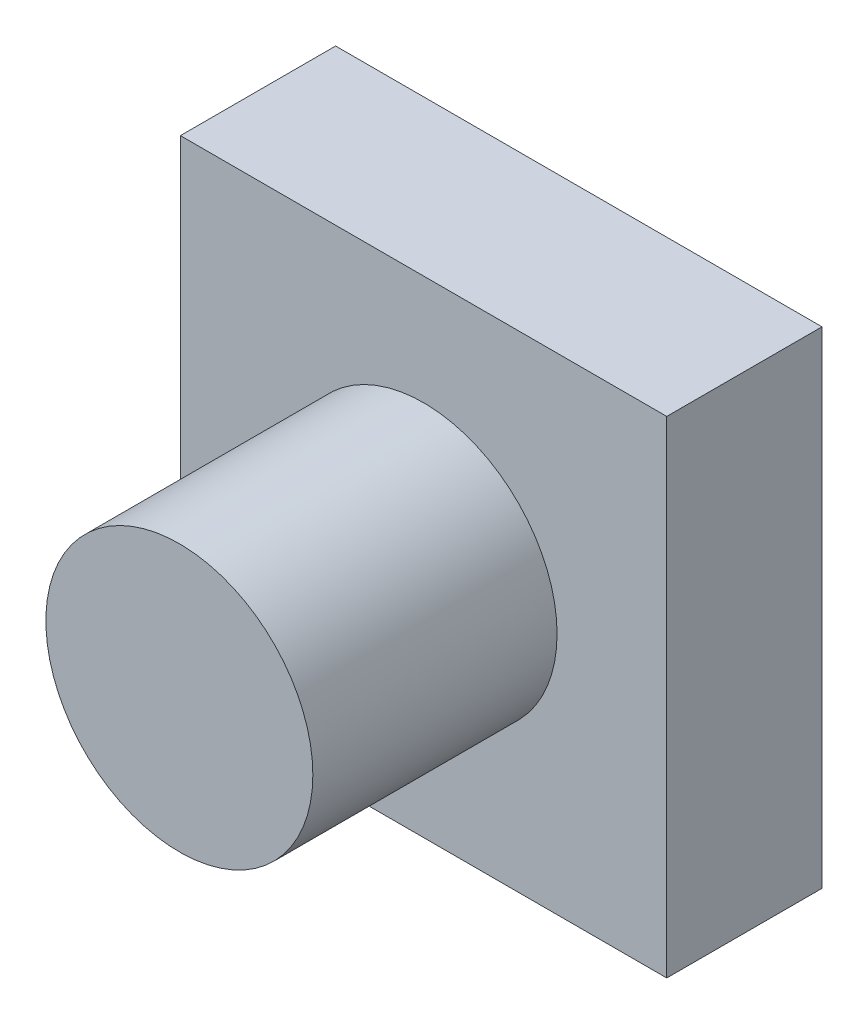
ISO-10303-21;
HEADER;
FILE_DESCRIPTION(('STEP AP214'),'2;1');
FILE_NAME('part.step','',(''),(''),'','','');
FILE_SCHEMA(('AUTOMOTIVE_DESIGN { 1 0 10303 214 1 1 1 1 }'));
ENDSEC;
DATA;
#1=APPLICATION_CONTEXT('core data for automotive mechanical design processes');
#2=APPLICATION_PROTOCOL_DEFINITION('international standard','automotive_design',2000,#1);
#3=PRODUCT_CONTEXT('',#1,'mechanical');
#4=PRODUCT('Part','Part','',(#3));
#5=PRODUCT_RELATED_PRODUCT_CATEGORY('part','',(#4));
#6=PRODUCT_DEFINITION_FORMATION('','',#4);
#7=PRODUCT_DEFINITION_CONTEXT('part definition',#1,'design');
#8=PRODUCT_DEFINITION('design','',#6,#7);
#9=PRODUCT_DEFINITION_SHAPE('','',#8);
#10=(LENGTH_UNIT() NAMED_UNIT(*) SI_UNIT(.MILLI.,.METRE.));
#11=(NAMED_UNIT(*) PLANE_ANGLE_UNIT() SI_UNIT($,.RADIAN.));
#12=(NAMED_UNIT(*) SI_UNIT($,.STERADIAN.) SOLID_ANGLE_UNIT());
#13=UNCERTAINTY_MEASURE_WITH_UNIT(LENGTH_MEASURE(1.E-05),#10,'distance_accuracy_value','');
#14=(GEOMETRIC_REPRESENTATION_CONTEXT(3) GLOBAL_UNCERTAINTY_ASSIGNED_CONTEXT((#13)) GLOBAL_UNIT_ASSIGNED_CONTEXT((#10,
#11,#12)) REPRESENTATION_CONTEXT('',''));
#15=CARTESIAN_POINT('',(0.,0.,0.));
#16=DIRECTION('',(0.,0.,1.));
#17=DIRECTION('',(1.,0.,0.));
#18=AXIS2_PLACEMENT_3D('',#15,#16,#17);
#19=CARTESIAN_POINT('',(0.,0.,3.81));
#20=DIRECTION('',(1.,0.,0.));
#21=DIRECTION('',(0.,0.,-1.));
#22=AXIS2_PLACEMENT_3D('',#19,#20,#21);
#23=PLANE('',#22);
#24=DIRECTION('',(0.,-1.,0.));
#25=VECTOR('',#24,1.);
#26=CARTESIAN_POINT('',(0.,0.,0.));
#27=LINE('',#26,#25);
#28=CARTESIAN_POINT('',(0.,11.938,0.));
#29=VERTEX_POINT('',#28);
#30=CARTESIAN_POINT('',(0.,0.,0.));
#31=VERTEX_POINT('',#30);
#32=EDGE_CURVE('E103',#29,#31,#27,.T.);
#33=ORIENTED_EDGE('',*,*,#32,.T.);
#34=DIRECTION('',(0.,0.,-1.));
#35=VECTOR('',#34,1.);
#36=CARTESIAN_POINT('',(0.,0.,3.81));
#37=LINE('',#36,#35);
#38=CARTESIAN_POINT('',(0.,0.,3.81));
#39=VERTEX_POINT('',#38);
#40=EDGE_CURVE('E40',#39,#31,#37,.T.);
#41=ORIENTED_EDGE('',*,*,#40,.F.);
#42=DIRECTION('',(0.,-1.,0.));
#43=VECTOR('',#42,1.);
#44=CARTESIAN_POINT('',(0.,0.,3.81));
#45=LINE('',#44,#43);
#46=CARTESIAN_POINT('',(0.,11.938,3.81));
#47=VERTEX_POINT('',#46);
#48=EDGE_CURVE('E90',#47,#39,#45,.T.);
#49=ORIENTED_EDGE('',*,*,#48,.F.);
#50=DIRECTION('',(0.,0.,-1.));
#51=VECTOR('',#50,1.);
#52=CARTESIAN_POINT('',(0.,11.938,3.81));
#53=LINE('',#52,#51);
#54=EDGE_CURVE('E99',#47,#29,#53,.T.);
#55=ORIENTED_EDGE('',*,*,#54,.T.);
#56=EDGE_LOOP('',(#33,#41,#49,#55));
#57=FACE_BOUND('',#56,.T.);
#58=ADVANCED_FACE('F37',(#57),#23,.F.);
#59=CARTESIAN_POINT('',(0.,0.,3.81));
#60=DIRECTION('',(0.,1.,0.));
#61=DIRECTION('',(0.,0.,1.));
#62=AXIS2_PLACEMENT_3D('',#59,#60,#61);
#63=PLANE('',#62);
#64=DIRECTION('',(1.,0.,0.));
#65=VECTOR('',#64,1.);
#66=CARTESIAN_POINT('',(0.,0.,0.));
#67=LINE('',#66,#65);
#68=CARTESIAN_POINT('',(11.938,0.,0.));
#69=VERTEX_POINT('',#68);
#70=EDGE_CURVE('E95',#31,#69,#67,.T.);
#71=ORIENTED_EDGE('',*,*,#70,.T.);
#72=DIRECTION('',(0.,0.,-1.));
#73=VECTOR('',#72,1.);
#74=CARTESIAN_POINT('',(11.938,0.,3.81));
#75=LINE('',#74,#73);
#76=CARTESIAN_POINT('',(11.938,0.,3.81));
#77=VERTEX_POINT('',#76);
#78=EDGE_CURVE('E93',#77,#69,#75,.T.);
#79=ORIENTED_EDGE('',*,*,#78,.F.);
#80=DIRECTION('',(1.,0.,0.));
#81=VECTOR('',#80,1.);
#82=CARTESIAN_POINT('',(0.,0.,3.81));
#83=LINE('',#82,#81);
#84=EDGE_CURVE('E85',#39,#77,#83,.T.);
#85=ORIENTED_EDGE('',*,*,#84,.F.);
#86=ORIENTED_EDGE('',*,*,#40,.T.);
#87=EDGE_LOOP('',(#71,#79,#85,#86));
#88=FACE_BOUND('',#87,.T.);
#89=ADVANCED_FACE('F94',(#88),#63,.F.);
#90=CARTESIAN_POINT('',(11.938,0.,3.81));
#91=DIRECTION('',(-1.,0.,0.));
#92=DIRECTION('',(0.,0.,1.));
#93=AXIS2_PLACEMENT_3D('',#90,#91,#92);
#94=PLANE('',#93);
#95=DIRECTION('',(0.,1.,0.));
#96=VECTOR('',#95,1.);
#97=CARTESIAN_POINT('',(11.938,0.,0.));
#98=LINE('',#97,#96);
#99=CARTESIAN_POINT('',(11.938,11.938,0.));
#100=VERTEX_POINT('',#99);
#101=EDGE_CURVE('E71',#69,#100,#98,.T.);
#102=ORIENTED_EDGE('',*,*,#101,.T.);
#103=DIRECTION('',(0.,0.,-1.));
#104=VECTOR('',#103,1.);
#105=CARTESIAN_POINT('',(11.938,11.938,3.81));
#106=LINE('',#105,#104);
#107=CARTESIAN_POINT('',(11.938,11.938,3.81));
#108=VERTEX_POINT('',#107);
#109=EDGE_CURVE('E96',#108,#100,#106,.T.);
#110=ORIENTED_EDGE('',*,*,#109,.F.);
#111=DIRECTION('',(0.,1.,0.));
#112=VECTOR('',#111,1.);
#113=CARTESIAN_POINT('',(11.938,0.,3.81));
#114=LINE('',#113,#112);
#115=EDGE_CURVE('E88',#77,#108,#114,.T.);
#116=ORIENTED_EDGE('',*,*,#115,.F.);
#117=ORIENTED_EDGE('',*,*,#78,.T.);
#118=EDGE_LOOP('',(#102,#110,#116,#117));
#119=FACE_BOUND('',#118,.T.);
#120=ADVANCED_FACE('F97',(#119),#94,.F.);
#121=CARTESIAN_POINT('',(0.,11.938,3.81));
#122=DIRECTION('',(0.,-1.,0.));
#123=DIRECTION('',(0.,0.,-1.));
#124=AXIS2_PLACEMENT_3D('',#121,#122,#123);
#125=PLANE('',#124);
#126=DIRECTION('',(-1.,0.,0.));
#127=VECTOR('',#126,1.);
#128=CARTESIAN_POINT('',(0.,11.938,0.));
#129=LINE('',#128,#127);
#130=EDGE_CURVE('E77',#100,#29,#129,.T.);
#131=ORIENTED_EDGE('',*,*,#130,.T.);
#132=ORIENTED_EDGE('',*,*,#54,.F.);
#133=DIRECTION('',(-1.,0.,0.));
#134=VECTOR('',#133,1.);
#135=CARTESIAN_POINT('',(0.,11.938,3.81));
#136=LINE('',#135,#134);
#137=EDGE_CURVE('E54',#108,#47,#136,.T.);
#138=ORIENTED_EDGE('',*,*,#137,.F.);
#139=ORIENTED_EDGE('',*,*,#109,.T.);
#140=EDGE_LOOP('',(#131,#132,#138,#139));
#141=FACE_BOUND('',#140,.T.);
#142=ADVANCED_FACE('F111',(#141),#125,.F.);
#143=CARTESIAN_POINT('',(0.,0.,3.81));
#144=DIRECTION('',(0.,0.,-1.));
#145=DIRECTION('',(-1.,0.,0.));
#146=AXIS2_PLACEMENT_3D('',#143,#144,#145);
#147=PLANE('',#146);
#148=CARTESIAN_POINT('',(5.969,5.969,3.81));
#149=DIRECTION('',(0.,0.,1.));
#150=DIRECTION('',(1.,0.,0.));
#151=AXIS2_PLACEMENT_3D('',#148,#149,#150);
#152=CIRCLE('',#151,3.2766);
#153=CARTESIAN_POINT('',(9.2456,5.969,3.81));
#154=VERTEX_POINT('',#153);
#155=EDGE_CURVE('E11',#154,#154,#152,.T.);
#156=ORIENTED_EDGE('',*,*,#155,.F.);
#157=EDGE_LOOP('',(#156));
#158=FACE_BOUND('',#157,.T.);
#159=ORIENTED_EDGE('',*,*,#48,.T.);
#160=ORIENTED_EDGE('',*,*,#84,.T.);
#161=ORIENTED_EDGE('',*,*,#115,.T.);
#162=ORIENTED_EDGE('',*,*,#137,.T.);
#163=EDGE_LOOP('',(#159,#160,#161,#162));
#164=FACE_BOUND('',#163,.T.);
#165=ADVANCED_FACE('F86',(#158,#164),#147,.F.);
#166=CARTESIAN_POINT('',(0.,0.,0.));
#167=DIRECTION('',(0.,0.,-1.));
#168=DIRECTION('',(-1.,0.,0.));
#169=AXIS2_PLACEMENT_3D('',#166,#167,#168);
#170=PLANE('',#169);
#171=ORIENTED_EDGE('',*,*,#32,.F.);
#172=ORIENTED_EDGE('',*,*,#130,.F.);
#173=ORIENTED_EDGE('',*,*,#101,.F.);
#174=ORIENTED_EDGE('',*,*,#70,.F.);
#175=EDGE_LOOP('',(#171,#172,#173,#174));
#176=FACE_BOUND('',#175,.T.);
#177=ADVANCED_FACE('F114',(#176),#170,.T.);
#178=CARTESIAN_POINT('',(5.969,5.969,9.8044));
#179=DIRECTION('',(0.,0.,-1.));
#180=DIRECTION('',(-1.,0.,0.));
#181=AXIS2_PLACEMENT_3D('',#178,#179,#180);
#182=CYLINDRICAL_SURFACE('',#181,3.2766);
#183=CARTESIAN_POINT('',(5.969,5.969,9.8044));
#184=DIRECTION('',(0.,0.,1.));
#185=DIRECTION('',(1.,0.,0.));
#186=AXIS2_PLACEMENT_3D('',#183,#184,#185);
#187=CIRCLE('',#186,3.2766);
#188=CARTESIAN_POINT('',(9.2456,5.969,9.8044));
#189=VERTEX_POINT('',#188);
#190=EDGE_CURVE('E106',#189,#189,#187,.T.);
#191=ORIENTED_EDGE('',*,*,#190,.F.);
#192=EDGE_LOOP('',(#191));
#193=FACE_BOUND('',#192,.T.);
#194=ORIENTED_EDGE('',*,*,#155,.T.);
#195=EDGE_LOOP('',(#194));
#196=FACE_BOUND('',#195,.T.);
#197=ADVANCED_FACE('F122',(#193,#196),#182,.T.);
#198=CARTESIAN_POINT('',(5.969,5.969,9.8044));
#199=DIRECTION('',(0.,0.,1.));
#200=DIRECTION('',(1.,0.,0.));
#201=AXIS2_PLACEMENT_3D('',#198,#199,#200);
#202=PLANE('',#201);
#203=ORIENTED_EDGE('',*,*,#190,.T.);
#204=EDGE_LOOP('',(#203));
#205=FACE_BOUND('',#204,.T.);
#206=ADVANCED_FACE('F120',(#205),#202,.T.);
#207=CLOSED_SHELL('',(#58,#89,#120,#142,#165,#177,#197,#206));
#208=MANIFOLD_SOLID_BREP('B2',#207);
#209=ADVANCED_BREP_SHAPE_REPRESENTATION('',(#18,#208),#14);
#210=SHAPE_DEFINITION_REPRESENTATION(#9,#209);
ENDSEC;
END-ISO-10303-21;
